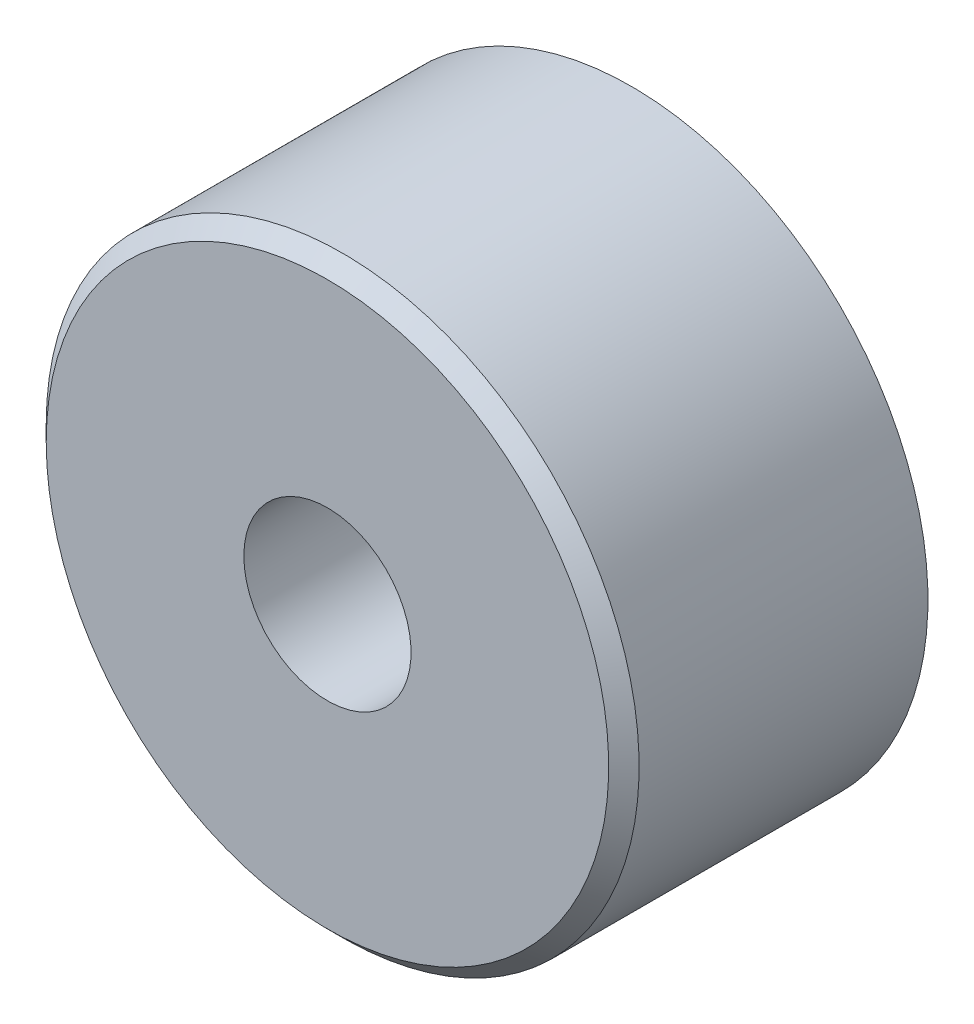
ISO-10303-21;
HEADER;
FILE_DESCRIPTION(('STEP AP214'),'2;1');
FILE_NAME('part.step','',(''),(''),'','','');
FILE_SCHEMA(('AUTOMOTIVE_DESIGN { 1 0 10303 214 1 1 1 1 }'));
ENDSEC;
DATA;
#1=APPLICATION_CONTEXT('core data for automotive mechanical design processes');
#2=APPLICATION_PROTOCOL_DEFINITION('international standard','automotive_design',2000,#1);
#3=PRODUCT_CONTEXT('',#1,'mechanical');
#4=PRODUCT('Part','Part','',(#3));
#5=PRODUCT_RELATED_PRODUCT_CATEGORY('part','',(#4));
#6=PRODUCT_DEFINITION_FORMATION('','',#4);
#7=PRODUCT_DEFINITION_CONTEXT('part definition',#1,'design');
#8=PRODUCT_DEFINITION('design','',#6,#7);
#9=PRODUCT_DEFINITION_SHAPE('','',#8);
#10=(LENGTH_UNIT() NAMED_UNIT(*) SI_UNIT(.MILLI.,.METRE.));
#11=(NAMED_UNIT(*) PLANE_ANGLE_UNIT() SI_UNIT($,.RADIAN.));
#12=(NAMED_UNIT(*) SI_UNIT($,.STERADIAN.) SOLID_ANGLE_UNIT());
#13=UNCERTAINTY_MEASURE_WITH_UNIT(LENGTH_MEASURE(1.E-05),#10,'distance_accuracy_value','');
#14=(GEOMETRIC_REPRESENTATION_CONTEXT(3) GLOBAL_UNCERTAINTY_ASSIGNED_CONTEXT((#13)) GLOBAL_UNIT_ASSIGNED_CONTEXT((#10,
#11,#12)) REPRESENTATION_CONTEXT('',''));
#15=CARTESIAN_POINT('',(0.,0.,0.));
#16=DIRECTION('',(0.,0.,1.));
#17=DIRECTION('',(1.,0.,0.));
#18=AXIS2_PLACEMENT_3D('',#15,#16,#17);
#19=CARTESIAN_POINT('',(0.,0.,10.));
#20=DIRECTION('',(0.,0.,-1.));
#21=DIRECTION('',(-1.,0.,0.));
#22=AXIS2_PLACEMENT_3D('',#19,#20,#21);
#23=CYLINDRICAL_SURFACE('',#22,2.75);
#24=CARTESIAN_POINT('',(0.,0.,10.));
#25=DIRECTION('',(0.,0.,-1.));
#26=DIRECTION('',(-1.,0.,0.));
#27=AXIS2_PLACEMENT_3D('',#24,#25,#26);
#28=CIRCLE('',#27,2.75);
#29=CARTESIAN_POINT('',(-2.75,0.,10.));
#30=VERTEX_POINT('',#29);
#31=EDGE_CURVE('E36',#30,#30,#28,.T.);
#32=ORIENTED_EDGE('',*,*,#31,.F.);
#33=EDGE_LOOP('',(#32));
#34=FACE_BOUND('',#33,.T.);
#35=CARTESIAN_POINT('',(0.,0.,6.));
#36=DIRECTION('',(0.,0.,-1.));
#37=DIRECTION('',(-1.,0.,0.));
#38=AXIS2_PLACEMENT_3D('',#35,#36,#37);
#39=CIRCLE('',#38,2.75);
#40=CARTESIAN_POINT('',(-2.75,0.,6.));
#41=VERTEX_POINT('',#40);
#42=EDGE_CURVE('E17',#41,#41,#39,.F.);
#43=ORIENTED_EDGE('',*,*,#42,.F.);
#44=EDGE_LOOP('',(#43));
#45=FACE_BOUND('',#44,.T.);
#46=ADVANCED_FACE('F14',(#34,#45),#23,.F.);
#47=CARTESIAN_POINT('',(0.,0.,6.));
#48=DIRECTION('',(0.,0.,-1.));
#49=DIRECTION('',(-1.,0.,0.));
#50=AXIS2_PLACEMENT_3D('',#47,#48,#49);
#51=PLANE('',#50);
#52=CARTESIAN_POINT('',(0.,0.,6.));
#53=DIRECTION('',(0.,0.,-1.));
#54=DIRECTION('',(-1.,0.,0.));
#55=AXIS2_PLACEMENT_3D('',#52,#53,#54);
#56=CIRCLE('',#55,5.25);
#57=CARTESIAN_POINT('',(-5.25,0.,6.));
#58=VERTEX_POINT('',#57);
#59=EDGE_CURVE('E34',#58,#58,#56,.T.);
#60=ORIENTED_EDGE('',*,*,#59,.T.);
#61=EDGE_LOOP('',(#60));
#62=FACE_BOUND('',#61,.T.);
#63=ORIENTED_EDGE('',*,*,#42,.T.);
#64=EDGE_LOOP('',(#63));
#65=FACE_BOUND('',#64,.T.);
#66=ADVANCED_FACE('F43',(#62,#65),#51,.T.);
#67=CARTESIAN_POINT('',(0.,0.,10.));
#68=DIRECTION('',(0.,0.,1.));
#69=DIRECTION('',(1.,0.,0.));
#70=AXIS2_PLACEMENT_3D('',#67,#68,#69);
#71=PLANE('',#70);
#72=ORIENTED_EDGE('',*,*,#31,.T.);
#73=EDGE_LOOP('',(#72));
#74=FACE_BOUND('',#73,.T.);
#75=CARTESIAN_POINT('',(0.,0.,10.));
#76=DIRECTION('',(0.,0.,-1.));
#77=DIRECTION('',(-1.,0.,0.));
#78=AXIS2_PLACEMENT_3D('',#75,#76,#77);
#79=CIRCLE('',#78,9.25000000000001);
#80=CARTESIAN_POINT('',(-9.25000000000001,0.,10.));
#81=VERTEX_POINT('',#80);
#82=EDGE_CURVE('E31',#81,#81,#79,.T.);
#83=ORIENTED_EDGE('',*,*,#82,.F.);
#84=EDGE_LOOP('',(#83));
#85=FACE_BOUND('',#84,.T.);
#86=ADVANCED_FACE('F51',(#74,#85),#71,.T.);
#87=CARTESIAN_POINT('',(0.,0.,6.));
#88=DIRECTION('',(0.,0.,-1.));
#89=DIRECTION('',(-1.,0.,0.));
#90=AXIS2_PLACEMENT_3D('',#87,#88,#89);
#91=CYLINDRICAL_SURFACE('',#90,5.25);
#92=ORIENTED_EDGE('',*,*,#59,.F.);
#93=EDGE_LOOP('',(#92));
#94=FACE_BOUND('',#93,.T.);
#95=CARTESIAN_POINT('',(0.,0.,0.));
#96=DIRECTION('',(0.,0.,-1.));
#97=DIRECTION('',(-1.,0.,0.));
#98=AXIS2_PLACEMENT_3D('',#95,#96,#97);
#99=CIRCLE('',#98,5.25);
#100=CARTESIAN_POINT('',(-5.25,0.,0.));
#101=VERTEX_POINT('',#100);
#102=EDGE_CURVE('E26',#101,#101,#99,.T.);
#103=ORIENTED_EDGE('',*,*,#102,.T.);
#104=EDGE_LOOP('',(#103));
#105=FACE_BOUND('',#104,.T.);
#106=ADVANCED_FACE('F68',(#94,#105),#91,.F.);
#107=CARTESIAN_POINT('',(0.,0.,9.50000000000001));
#108=DIRECTION('',(0.,0.,-1.));
#109=DIRECTION('',(-1.,0.,0.));
#110=AXIS2_PLACEMENT_3D('',#107,#108,#109);
#111=CONICAL_SURFACE('',#110,9.75,0.785398163397448);
#112=CARTESIAN_POINT('',(0.,0.,9.50000000000001));
#113=DIRECTION('',(0.,0.,-1.));
#114=DIRECTION('',(-1.,0.,0.));
#115=AXIS2_PLACEMENT_3D('',#112,#113,#114);
#116=CIRCLE('',#115,9.75);
#117=CARTESIAN_POINT('',(-9.75,0.,9.50000000000001));
#118=VERTEX_POINT('',#117);
#119=EDGE_CURVE('E21',#118,#118,#116,.T.);
#120=ORIENTED_EDGE('',*,*,#119,.F.);
#121=EDGE_LOOP('',(#120));
#122=FACE_BOUND('',#121,.T.);
#123=ORIENTED_EDGE('',*,*,#82,.T.);
#124=EDGE_LOOP('',(#123));
#125=FACE_BOUND('',#124,.T.);
#126=ADVANCED_FACE('F61',(#122,#125),#111,.T.);
#127=CARTESIAN_POINT('',(0.,0.,0.));
#128=DIRECTION('',(0.,0.,1.));
#129=DIRECTION('',(1.,0.,0.));
#130=AXIS2_PLACEMENT_3D('',#127,#128,#129);
#131=PLANE('',#130);
#132=CARTESIAN_POINT('',(0.,0.,0.));
#133=DIRECTION('',(0.,0.,-1.));
#134=DIRECTION('',(-1.,0.,0.));
#135=AXIS2_PLACEMENT_3D('',#132,#133,#134);
#136=CIRCLE('',#135,9.75);
#137=CARTESIAN_POINT('',(-9.75,0.,0.));
#138=VERTEX_POINT('',#137);
#139=EDGE_CURVE('E10',#138,#138,#136,.F.);
#140=ORIENTED_EDGE('',*,*,#139,.F.);
#141=EDGE_LOOP('',(#140));
#142=FACE_BOUND('',#141,.T.);
#143=ORIENTED_EDGE('',*,*,#102,.F.);
#144=EDGE_LOOP('',(#143));
#145=FACE_BOUND('',#144,.T.);
#146=ADVANCED_FACE('F55',(#142,#145),#131,.F.);
#147=CARTESIAN_POINT('',(0.,0.,10.));
#148=DIRECTION('',(0.,0.,-1.));
#149=DIRECTION('',(-1.,0.,0.));
#150=AXIS2_PLACEMENT_3D('',#147,#148,#149);
#151=CYLINDRICAL_SURFACE('',#150,9.75);
#152=ORIENTED_EDGE('',*,*,#139,.T.);
#153=EDGE_LOOP('',(#152));
#154=FACE_BOUND('',#153,.T.);
#155=ORIENTED_EDGE('',*,*,#119,.T.);
#156=EDGE_LOOP('',(#155));
#157=FACE_BOUND('',#156,.T.);
#158=ADVANCED_FACE('F53',(#154,#157),#151,.T.);
#159=CLOSED_SHELL('',(#46,#66,#86,#106,#126,#146,#158));
#160=MANIFOLD_SOLID_BREP('B1',#159);
#161=ADVANCED_BREP_SHAPE_REPRESENTATION('',(#18,#160),#14);
#162=SHAPE_DEFINITION_REPRESENTATION(#9,#161);
ENDSEC;
END-ISO-10303-21;
